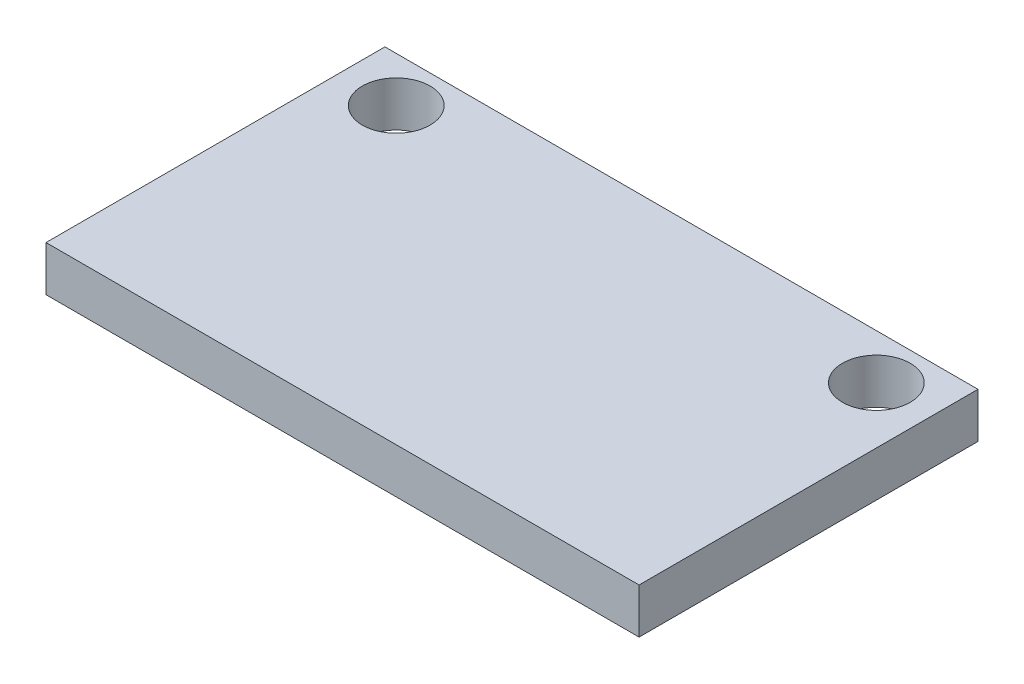
ISO-10303-21;
HEADER;
FILE_DESCRIPTION(('STEP AP214'),'2;1');
FILE_NAME('part.step','',(''),(''),'','','');
FILE_SCHEMA(('AUTOMOTIVE_DESIGN { 1 0 10303 214 1 1 1 1 }'));
ENDSEC;
DATA;
#1=APPLICATION_CONTEXT('core data for automotive mechanical design processes');
#2=APPLICATION_PROTOCOL_DEFINITION('international standard','automotive_design',2000,#1);
#3=PRODUCT_CONTEXT('',#1,'mechanical');
#4=PRODUCT('Part','Part','',(#3));
#5=PRODUCT_RELATED_PRODUCT_CATEGORY('part','',(#4));
#6=PRODUCT_DEFINITION_FORMATION('','',#4);
#7=PRODUCT_DEFINITION_CONTEXT('part definition',#1,'design');
#8=PRODUCT_DEFINITION('design','',#6,#7);
#9=PRODUCT_DEFINITION_SHAPE('','',#8);
#10=(LENGTH_UNIT() NAMED_UNIT(*) SI_UNIT(.MILLI.,.METRE.));
#11=(NAMED_UNIT(*) PLANE_ANGLE_UNIT() SI_UNIT($,.RADIAN.));
#12=(NAMED_UNIT(*) SI_UNIT($,.STERADIAN.) SOLID_ANGLE_UNIT());
#13=UNCERTAINTY_MEASURE_WITH_UNIT(LENGTH_MEASURE(1.E-05),#10,'distance_accuracy_value','');
#14=(GEOMETRIC_REPRESENTATION_CONTEXT(3) GLOBAL_UNCERTAINTY_ASSIGNED_CONTEXT((#13)) GLOBAL_UNIT_ASSIGNED_CONTEXT((#10,
#11,#12)) REPRESENTATION_CONTEXT('',''));
#15=CARTESIAN_POINT('',(0.,0.,0.));
#16=DIRECTION('',(0.,0.,1.));
#17=DIRECTION('',(1.,0.,0.));
#18=AXIS2_PLACEMENT_3D('',#15,#16,#17);
#19=CARTESIAN_POINT('',(0.,1.,0.));
#20=DIRECTION('',(0.,1.,0.));
#21=DIRECTION('',(0.,0.,1.));
#22=AXIS2_PLACEMENT_3D('',#19,#20,#21);
#23=PLANE('',#22);
#24=CARTESIAN_POINT('',(-10.625,1.,-5.5));
#25=DIRECTION('',(0.,1.,0.));
#26=DIRECTION('',(0.,0.,1.));
#27=AXIS2_PLACEMENT_3D('',#24,#25,#26);
#28=CIRCLE('',#27,1.5);
#29=CARTESIAN_POINT('',(-10.625,1.,-4.));
#30=VERTEX_POINT('',#29);
#31=EDGE_CURVE('E99',#30,#30,#28,.T.);
#32=ORIENTED_EDGE('',*,*,#31,.F.);
#33=EDGE_LOOP('',(#32));
#34=FACE_BOUND('',#33,.T.);
#35=DIRECTION('',(0.,0.,-1.));
#36=VECTOR('',#35,1.);
#37=CARTESIAN_POINT('',(13.125,1.,-7.5));
#38=LINE('',#37,#36);
#39=CARTESIAN_POINT('',(13.125,1.,7.5));
#40=VERTEX_POINT('',#39);
#41=CARTESIAN_POINT('',(13.125,1.,-7.5));
#42=VERTEX_POINT('',#41);
#43=EDGE_CURVE('E84',#40,#42,#38,.T.);
#44=ORIENTED_EDGE('',*,*,#43,.T.);
#45=DIRECTION('',(-1.,0.,0.));
#46=VECTOR('',#45,1.);
#47=CARTESIAN_POINT('',(-13.125,1.,-7.5));
#48=LINE('',#47,#46);
#49=CARTESIAN_POINT('',(-13.125,1.,-7.5));
#50=VERTEX_POINT('',#49);
#51=EDGE_CURVE('E79',#42,#50,#48,.T.);
#52=ORIENTED_EDGE('',*,*,#51,.T.);
#53=DIRECTION('',(0.,0.,1.));
#54=VECTOR('',#53,1.);
#55=CARTESIAN_POINT('',(-13.125,1.,-7.5));
#56=LINE('',#55,#54);
#57=CARTESIAN_POINT('',(-13.125,1.,7.5));
#58=VERTEX_POINT('',#57);
#59=EDGE_CURVE('E82',#50,#58,#56,.T.);
#60=ORIENTED_EDGE('',*,*,#59,.T.);
#61=DIRECTION('',(1.,0.,0.));
#62=VECTOR('',#61,1.);
#63=CARTESIAN_POINT('',(-13.125,1.,7.5));
#64=LINE('',#63,#62);
#65=EDGE_CURVE('E49',#58,#40,#64,.T.);
#66=ORIENTED_EDGE('',*,*,#65,.T.);
#67=EDGE_LOOP('',(#44,#52,#60,#66));
#68=FACE_BOUND('',#67,.T.);
#69=CARTESIAN_POINT('',(10.625,1.,-5.5));
#70=DIRECTION('',(0.,1.,0.));
#71=DIRECTION('',(0.,0.,1.));
#72=AXIS2_PLACEMENT_3D('',#69,#70,#71);
#73=CIRCLE('',#72,1.5);
#74=CARTESIAN_POINT('',(10.625,1.,-4.));
#75=VERTEX_POINT('',#74);
#76=EDGE_CURVE('E114',#75,#75,#73,.T.);
#77=ORIENTED_EDGE('',*,*,#76,.F.);
#78=EDGE_LOOP('',(#77));
#79=FACE_BOUND('',#78,.T.);
#80=ADVANCED_FACE('F32',(#34,#68,#79),#23,.T.);
#81=CARTESIAN_POINT('',(0.,-1.,0.));
#82=DIRECTION('',(0.,1.,0.));
#83=DIRECTION('',(0.,0.,1.));
#84=AXIS2_PLACEMENT_3D('',#81,#82,#83);
#85=PLANE('',#84);
#86=DIRECTION('',(0.,0.,-1.));
#87=VECTOR('',#86,1.);
#88=CARTESIAN_POINT('',(13.125,-1.,-7.5));
#89=LINE('',#88,#87);
#90=CARTESIAN_POINT('',(13.125,-1.,7.5));
#91=VERTEX_POINT('',#90);
#92=CARTESIAN_POINT('',(13.125,-1.,-7.5));
#93=VERTEX_POINT('',#92);
#94=EDGE_CURVE('E96',#91,#93,#89,.T.);
#95=ORIENTED_EDGE('',*,*,#94,.F.);
#96=DIRECTION('',(1.,0.,0.));
#97=VECTOR('',#96,1.);
#98=CARTESIAN_POINT('',(-13.125,-1.,7.5));
#99=LINE('',#98,#97);
#100=CARTESIAN_POINT('',(-13.125,-1.,7.5));
#101=VERTEX_POINT('',#100);
#102=EDGE_CURVE('E72',#101,#91,#99,.T.);
#103=ORIENTED_EDGE('',*,*,#102,.F.);
#104=DIRECTION('',(0.,0.,1.));
#105=VECTOR('',#104,1.);
#106=CARTESIAN_POINT('',(-13.125,-1.,-7.5));
#107=LINE('',#106,#105);
#108=CARTESIAN_POINT('',(-13.125,-1.,-7.5));
#109=VERTEX_POINT('',#108);
#110=EDGE_CURVE('E66',#109,#101,#107,.T.);
#111=ORIENTED_EDGE('',*,*,#110,.F.);
#112=DIRECTION('',(-1.,0.,0.));
#113=VECTOR('',#112,1.);
#114=CARTESIAN_POINT('',(-13.125,-1.,-7.5));
#115=LINE('',#114,#113);
#116=EDGE_CURVE('E88',#93,#109,#115,.T.);
#117=ORIENTED_EDGE('',*,*,#116,.F.);
#118=EDGE_LOOP('',(#95,#103,#111,#117));
#119=FACE_BOUND('',#118,.T.);
#120=CARTESIAN_POINT('',(-10.625,-1.,-5.5));
#121=DIRECTION('',(0.,1.,0.));
#122=DIRECTION('',(0.,0.,1.));
#123=AXIS2_PLACEMENT_3D('',#120,#121,#122);
#124=CIRCLE('',#123,1.5);
#125=CARTESIAN_POINT('',(-10.625,-1.,-4.));
#126=VERTEX_POINT('',#125);
#127=EDGE_CURVE('E111',#126,#126,#124,.T.);
#128=ORIENTED_EDGE('',*,*,#127,.T.);
#129=EDGE_LOOP('',(#128));
#130=FACE_BOUND('',#129,.T.);
#131=CARTESIAN_POINT('',(10.625,-1.,-5.5));
#132=DIRECTION('',(0.,1.,0.));
#133=DIRECTION('',(0.,0.,1.));
#134=AXIS2_PLACEMENT_3D('',#131,#132,#133);
#135=CIRCLE('',#134,1.5);
#136=CARTESIAN_POINT('',(10.625,-1.,-4.));
#137=VERTEX_POINT('',#136);
#138=EDGE_CURVE('E117',#137,#137,#135,.T.);
#139=ORIENTED_EDGE('',*,*,#138,.T.);
#140=EDGE_LOOP('',(#139));
#141=FACE_BOUND('',#140,.T.);
#142=ADVANCED_FACE('F107',(#119,#130,#141),#85,.F.);
#143=CARTESIAN_POINT('',(13.125,1.,-7.5));
#144=DIRECTION('',(-1.,0.,0.));
#145=DIRECTION('',(0.,0.,1.));
#146=AXIS2_PLACEMENT_3D('',#143,#144,#145);
#147=PLANE('',#146);
#148=ORIENTED_EDGE('',*,*,#94,.T.);
#149=DIRECTION('',(0.,-1.,0.));
#150=VECTOR('',#149,1.);
#151=CARTESIAN_POINT('',(13.125,1.,-7.5));
#152=LINE('',#151,#150);
#153=EDGE_CURVE('E11',#42,#93,#152,.T.);
#154=ORIENTED_EDGE('',*,*,#153,.F.);
#155=ORIENTED_EDGE('',*,*,#43,.F.);
#156=DIRECTION('',(0.,-1.,0.));
#157=VECTOR('',#156,1.);
#158=CARTESIAN_POINT('',(13.125,1.,7.5));
#159=LINE('',#158,#157);
#160=EDGE_CURVE('E92',#40,#91,#159,.T.);
#161=ORIENTED_EDGE('',*,*,#160,.T.);
#162=EDGE_LOOP('',(#148,#154,#155,#161));
#163=FACE_BOUND('',#162,.T.);
#164=ADVANCED_FACE('F34',(#163),#147,.F.);
#165=CARTESIAN_POINT('',(-13.125,1.,-7.5));
#166=DIRECTION('',(0.,0.,1.));
#167=DIRECTION('',(1.,0.,0.));
#168=AXIS2_PLACEMENT_3D('',#165,#166,#167);
#169=PLANE('',#168);
#170=ORIENTED_EDGE('',*,*,#116,.T.);
#171=DIRECTION('',(0.,-1.,0.));
#172=VECTOR('',#171,1.);
#173=CARTESIAN_POINT('',(-13.125,1.,-7.5));
#174=LINE('',#173,#172);
#175=EDGE_CURVE('E41',#50,#109,#174,.T.);
#176=ORIENTED_EDGE('',*,*,#175,.F.);
#177=ORIENTED_EDGE('',*,*,#51,.F.);
#178=ORIENTED_EDGE('',*,*,#153,.T.);
#179=EDGE_LOOP('',(#170,#176,#177,#178));
#180=FACE_BOUND('',#179,.T.);
#181=ADVANCED_FACE('F87',(#180),#169,.F.);
#182=CARTESIAN_POINT('',(-13.125,1.,-7.5));
#183=DIRECTION('',(1.,0.,0.));
#184=DIRECTION('',(0.,0.,-1.));
#185=AXIS2_PLACEMENT_3D('',#182,#183,#184);
#186=PLANE('',#185);
#187=ORIENTED_EDGE('',*,*,#110,.T.);
#188=DIRECTION('',(0.,-1.,0.));
#189=VECTOR('',#188,1.);
#190=CARTESIAN_POINT('',(-13.125,1.,7.5));
#191=LINE('',#190,#189);
#192=EDGE_CURVE('E89',#58,#101,#191,.T.);
#193=ORIENTED_EDGE('',*,*,#192,.F.);
#194=ORIENTED_EDGE('',*,*,#59,.F.);
#195=ORIENTED_EDGE('',*,*,#175,.T.);
#196=EDGE_LOOP('',(#187,#193,#194,#195));
#197=FACE_BOUND('',#196,.T.);
#198=ADVANCED_FACE('F90',(#197),#186,.F.);
#199=CARTESIAN_POINT('',(-13.125,1.,7.5));
#200=DIRECTION('',(0.,0.,-1.));
#201=DIRECTION('',(-1.,0.,0.));
#202=AXIS2_PLACEMENT_3D('',#199,#200,#201);
#203=PLANE('',#202);
#204=ORIENTED_EDGE('',*,*,#102,.T.);
#205=ORIENTED_EDGE('',*,*,#160,.F.);
#206=ORIENTED_EDGE('',*,*,#65,.F.);
#207=ORIENTED_EDGE('',*,*,#192,.T.);
#208=EDGE_LOOP('',(#204,#205,#206,#207));
#209=FACE_BOUND('',#208,.T.);
#210=ADVANCED_FACE('F104',(#209),#203,.F.);
#211=CARTESIAN_POINT('',(-10.625,1.,-5.5));
#212=DIRECTION('',(0.,-1.,0.));
#213=DIRECTION('',(0.,0.,-1.));
#214=AXIS2_PLACEMENT_3D('',#211,#212,#213);
#215=CYLINDRICAL_SURFACE('',#214,1.5);
#216=ORIENTED_EDGE('',*,*,#31,.T.);
#217=EDGE_LOOP('',(#216));
#218=FACE_BOUND('',#217,.T.);
#219=ORIENTED_EDGE('',*,*,#127,.F.);
#220=EDGE_LOOP('',(#219));
#221=FACE_BOUND('',#220,.T.);
#222=ADVANCED_FACE('F134',(#218,#221),#215,.F.);
#223=CARTESIAN_POINT('',(10.625,1.,-5.5));
#224=DIRECTION('',(0.,-1.,0.));
#225=DIRECTION('',(0.,0.,-1.));
#226=AXIS2_PLACEMENT_3D('',#223,#224,#225);
#227=CYLINDRICAL_SURFACE('',#226,1.5);
#228=ORIENTED_EDGE('',*,*,#76,.T.);
#229=EDGE_LOOP('',(#228));
#230=FACE_BOUND('',#229,.T.);
#231=ORIENTED_EDGE('',*,*,#138,.F.);
#232=EDGE_LOOP('',(#231));
#233=FACE_BOUND('',#232,.T.);
#234=ADVANCED_FACE('F123',(#230,#233),#227,.F.);
#235=CLOSED_SHELL('',(#80,#142,#164,#181,#198,#210,#222,#234));
#236=MANIFOLD_SOLID_BREP('B2',#235);
#237=ADVANCED_BREP_SHAPE_REPRESENTATION('',(#18,#236),#14);
#238=SHAPE_DEFINITION_REPRESENTATION(#9,#237);
ENDSEC;
END-ISO-10303-21;
